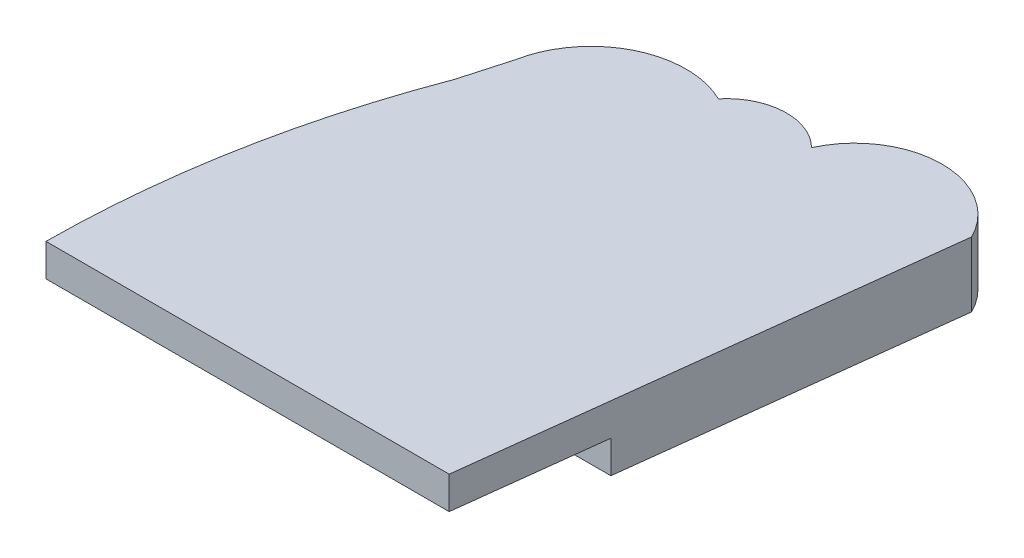
ISO-10303-21;
HEADER;
FILE_DESCRIPTION(('STEP AP214'),'2;1');
FILE_NAME('part.step','',(''),(''),'','','');
FILE_SCHEMA(('AUTOMOTIVE_DESIGN { 1 0 10303 214 1 1 1 1 }'));
ENDSEC;
DATA;
#1=APPLICATION_CONTEXT('core data for automotive mechanical design processes');
#2=APPLICATION_PROTOCOL_DEFINITION('international standard','automotive_design',2000,#1);
#3=PRODUCT_CONTEXT('',#1,'mechanical');
#4=PRODUCT('Part','Part','',(#3));
#5=PRODUCT_RELATED_PRODUCT_CATEGORY('part','',(#4));
#6=PRODUCT_DEFINITION_FORMATION('','',#4);
#7=PRODUCT_DEFINITION_CONTEXT('part definition',#1,'design');
#8=PRODUCT_DEFINITION('design','',#6,#7);
#9=PRODUCT_DEFINITION_SHAPE('','',#8);
#10=(LENGTH_UNIT() NAMED_UNIT(*) SI_UNIT(.MILLI.,.METRE.));
#11=(NAMED_UNIT(*) PLANE_ANGLE_UNIT() SI_UNIT($,.RADIAN.));
#12=(NAMED_UNIT(*) SI_UNIT($,.STERADIAN.) SOLID_ANGLE_UNIT());
#13=UNCERTAINTY_MEASURE_WITH_UNIT(LENGTH_MEASURE(1.E-05),#10,'distance_accuracy_value','');
#14=(GEOMETRIC_REPRESENTATION_CONTEXT(3) GLOBAL_UNCERTAINTY_ASSIGNED_CONTEXT((#13)) GLOBAL_UNIT_ASSIGNED_CONTEXT((#10,
#11,#12)) REPRESENTATION_CONTEXT('',''));
#15=CARTESIAN_POINT('',(0.,0.,0.));
#16=DIRECTION('',(0.,0.,1.));
#17=DIRECTION('',(1.,0.,0.));
#18=AXIS2_PLACEMENT_3D('',#15,#16,#17);
#19=CARTESIAN_POINT('',(113.450621235206,21.75,99.8017663174114));
#20=DIRECTION('',(0.992936608383073,0.,0.118646077612034));
#21=DIRECTION('',(0.118646077612034,0.,-0.992936608383073));
#22=AXIS2_PLACEMENT_3D('',#19,#20,#21);
#23=PLANE('',#22);
#24=DIRECTION('',(0.118646077612034,0.,-0.992936608383073));
#25=VECTOR('',#24,1.);
#26=CARTESIAN_POINT('',(113.450621235206,15.,99.8017663174114));
#27=LINE('',#26,#25);
#28=CARTESIAN_POINT('',(105.254766199258,15.,168.392019497163));
#29=VERTEX_POINT('',#28);
#30=CARTESIAN_POINT('',(108.839468685106,15.,138.392019497163));
#31=VERTEX_POINT('',#30);
#32=EDGE_CURVE('E50',#29,#31,#27,.T.);
#33=ORIENTED_EDGE('',*,*,#32,.T.);
#34=DIRECTION('',(0.,-1.,0.));
#35=VECTOR('',#34,1.);
#36=CARTESIAN_POINT('',(108.839468685106,21.75,138.392019497163));
#37=LINE('',#36,#35);
#38=CARTESIAN_POINT('',(108.839468685106,8.25,138.392019497163));
#39=VERTEX_POINT('',#38);
#40=EDGE_CURVE('E203',#31,#39,#37,.T.);
#41=ORIENTED_EDGE('',*,*,#40,.T.);
#42=DIRECTION('',(-0.118646077612034,0.,0.992936608383073));
#43=VECTOR('',#42,1.);
#44=CARTESIAN_POINT('',(113.450621235206,8.25,99.8017663174114));
#45=LINE('',#44,#43);
#46=CARTESIAN_POINT('',(116.839136919087,8.25,71.4436331340461));
#47=VERTEX_POINT('',#46);
#48=EDGE_CURVE('E149',#47,#39,#45,.T.);
#49=ORIENTED_EDGE('',*,*,#48,.F.);
#50=DIRECTION('',(0.,-1.,0.));
#51=VECTOR('',#50,1.);
#52=CARTESIAN_POINT('',(116.839136919087,21.75,71.4436331340461));
#53=LINE('',#52,#51);
#54=CARTESIAN_POINT('',(116.839136919087,21.75,71.4436331340461));
#55=VERTEX_POINT('',#54);
#56=EDGE_CURVE('E124',#55,#47,#53,.T.);
#57=ORIENTED_EDGE('',*,*,#56,.F.);
#58=DIRECTION('',(-0.118646077612034,0.,0.992936608383073));
#59=VECTOR('',#58,1.);
#60=CARTESIAN_POINT('',(113.450621235206,21.75,99.8017663174114));
#61=LINE('',#60,#59);
#62=CARTESIAN_POINT('',(105.254766199258,21.75,168.392019497163));
#63=VERTEX_POINT('',#62);
#64=EDGE_CURVE('E148',#55,#63,#61,.T.);
#65=ORIENTED_EDGE('',*,*,#64,.T.);
#66=DIRECTION('',(0.,-1.,0.));
#67=VECTOR('',#66,1.);
#68=CARTESIAN_POINT('',(105.254766199258,21.75,168.392019497163));
#69=LINE('',#68,#67);
#70=EDGE_CURVE('E137',#63,#29,#69,.T.);
#71=ORIENTED_EDGE('',*,*,#70,.T.);
#72=EDGE_LOOP('',(#33,#41,#49,#57,#65,#71));
#73=FACE_BOUND('',#72,.T.);
#74=ADVANCED_FACE('F36',(#73),#23,.T.);
#75=CARTESIAN_POINT('',(226.607768194537,21.75,169.442885886238));
#76=DIRECTION('',(0.,-1.,0.));
#77=DIRECTION('',(0.,0.,-1.));
#78=AXIS2_PLACEMENT_3D('',#75,#76,#77);
#79=CYLINDRICAL_SURFACE('',#78,205.108590526185);
#80=DIRECTION('',(0.,-1.,0.));
#81=VECTOR('',#80,1.);
#82=CARTESIAN_POINT('',(23.8631564187217,21.75,138.392019497163));
#83=LINE('',#82,#81);
#84=CARTESIAN_POINT('',(23.8631564187217,15.,138.392019497163));
#85=VERTEX_POINT('',#84);
#86=CARTESIAN_POINT('',(23.8631564187217,8.25,138.392019497163));
#87=VERTEX_POINT('',#86);
#88=EDGE_CURVE('E197',#85,#87,#83,.T.);
#89=ORIENTED_EDGE('',*,*,#88,.F.);
#90=CARTESIAN_POINT('',(226.607768194537,15.,169.442885886238));
#91=DIRECTION('',(0.,-1.,0.));
#92=DIRECTION('',(0.,0.,-1.));
#93=AXIS2_PLACEMENT_3D('',#90,#91,#92);
#94=CIRCLE('',#93,205.108590526185);
#95=CARTESIAN_POINT('',(21.5018697238431,15.,168.392019497163));
#96=VERTEX_POINT('',#95);
#97=EDGE_CURVE('E198',#96,#85,#94,.T.);
#98=ORIENTED_EDGE('',*,*,#97,.F.);
#99=DIRECTION('',(0.,-1.,0.));
#100=VECTOR('',#99,1.);
#101=CARTESIAN_POINT('',(21.5018697238431,21.75,168.392019497163));
#102=LINE('',#101,#100);
#103=CARTESIAN_POINT('',(21.5018697238431,21.75,168.392019497163));
#104=VERTEX_POINT('',#103);
#105=EDGE_CURVE('E140',#104,#96,#102,.T.);
#106=ORIENTED_EDGE('',*,*,#105,.F.);
#107=CARTESIAN_POINT('',(226.607768194537,21.75,169.442885886238));
#108=DIRECTION('',(0.,1.,0.));
#109=DIRECTION('',(0.,0.,1.));
#110=AXIS2_PLACEMENT_3D('',#107,#108,#109);
#111=CIRCLE('',#110,205.108590526185);
#112=CARTESIAN_POINT('',(34.7853182098476,21.75,96.822767533886));
#113=VERTEX_POINT('',#112);
#114=EDGE_CURVE('E59',#113,#104,#111,.T.);
#115=ORIENTED_EDGE('',*,*,#114,.F.);
#116=DIRECTION('',(0.,-1.,0.));
#117=VECTOR('',#116,1.);
#118=CARTESIAN_POINT('',(34.7853182098476,21.75,96.822767533886));
#119=LINE('',#118,#117);
#120=CARTESIAN_POINT('',(34.7853182098476,8.25,96.822767533886));
#121=VERTEX_POINT('',#120);
#122=EDGE_CURVE('E126',#113,#121,#119,.T.);
#123=ORIENTED_EDGE('',*,*,#122,.T.);
#124=CARTESIAN_POINT('',(226.607768194537,8.25,169.442885886238));
#125=DIRECTION('',(0.,1.,0.));
#126=DIRECTION('',(0.,0.,1.));
#127=AXIS2_PLACEMENT_3D('',#124,#125,#126);
#128=CIRCLE('',#127,205.108590526185);
#129=EDGE_CURVE('E84',#121,#87,#128,.T.);
#130=ORIENTED_EDGE('',*,*,#129,.T.);
#131=EDGE_LOOP('',(#89,#98,#106,#115,#123,#130));
#132=FACE_BOUND('',#131,.T.);
#133=ADVANCED_FACE('F174',(#132),#79,.T.);
#134=CARTESIAN_POINT('',(37.2193540619975,8.25,90.6928858862381));
#135=DIRECTION('',(0.,1.,0.));
#136=DIRECTION('',(0.,0.,1.));
#137=AXIS2_PLACEMENT_3D('',#134,#135,#136);
#138=PLANE('',#137);
#139=DIRECTION('',(1.,0.,0.));
#140=VECTOR('',#139,1.);
#141=CARTESIAN_POINT('',(37.2193540619975,8.25,138.392019497163));
#142=LINE('',#141,#140);
#143=EDGE_CURVE('E11',#87,#39,#142,.T.);
#144=ORIENTED_EDGE('',*,*,#143,.F.);
#145=ORIENTED_EDGE('',*,*,#129,.F.);
#146=CARTESIAN_POINT('',(37.5761668096674,8.25,86.9518447177438));
#147=CARTESIAN_POINT('',(36.2249381380187,8.25,91.8995280702332));
#148=CARTESIAN_POINT('',(34.7853182098476,8.25,96.822767533886));
#149=B_SPLINE_CURVE_WITH_KNOTS('',2,(#146,#147,#148),.UNSPECIFIED.,.F.,.F.,(3,3),
(0.221662646060155,1.),.UNSPECIFIED.);
#150=CARTESIAN_POINT('',(37.5761668096674,8.25,86.9518447177438));
#151=VERTEX_POINT('',#150);
#152=EDGE_CURVE('E212',#151,#121,#149,.T.);
#153=ORIENTED_EDGE('',*,*,#152,.F.);
#154=CARTESIAN_POINT('',(57.0094330479288,8.25,90.69288182531));
#155=DIRECTION('',(0.,1.,0.));
#156=DIRECTION('',(0.,0.,1.));
#157=AXIS2_PLACEMENT_3D('',#154,#155,#156);
#158=CIRCLE('',#157,19.7900782041743);
#159=CARTESIAN_POINT('',(65.6976283444023,8.25,72.9119240947019));
#160=VERTEX_POINT('',#159);
#161=EDGE_CURVE('E216',#151,#160,#158,.F.);
#162=ORIENTED_EDGE('',*,*,#161,.T.);
#163=CARTESIAN_POINT('',(75.3329787960748,8.25,80.8816169817695));
#164=DIRECTION('',(0.,1.,0.));
#165=DIRECTION('',(0.,0.,1.));
#166=AXIS2_PLACEMENT_3D('',#163,#164,#165);
#167=CIRCLE('',#166,12.5042386029987);
#168=CARTESIAN_POINT('',(84.1530179179057,8.25,72.0180458656732));
#169=VERTEX_POINT('',#168);
#170=EDGE_CURVE('E121',#169,#160,#167,.T.);
#171=ORIENTED_EDGE('',*,*,#170,.F.);
#172=CARTESIAN_POINT('',(100.633030436561,8.25,79.5239513157429));
#173=DIRECTION('',(0.,1.,0.));
#174=DIRECTION('',(0.,0.,1.));
#175=AXIS2_PLACEMENT_3D('',#172,#173,#174);
#176=CIRCLE('',#175,18.1088218622977);
#177=EDGE_CURVE('E152',#47,#169,#176,.T.);
#178=ORIENTED_EDGE('',*,*,#177,.F.);
#179=ORIENTED_EDGE('',*,*,#48,.T.);
#180=EDGE_LOOP('',(#144,#145,#153,#162,#171,#178,#179));
#181=FACE_BOUND('',#180,.T.);
#182=ADVANCED_FACE('F190',(#181),#138,.F.);
#183=CARTESIAN_POINT('',(0.,21.75,168.392019497163));
#184=DIRECTION('',(0.,0.,1.));
#185=DIRECTION('',(1.,0.,0.));
#186=AXIS2_PLACEMENT_3D('',#183,#184,#185);
#187=PLANE('',#186);
#188=ORIENTED_EDGE('',*,*,#105,.T.);
#189=DIRECTION('',(1.,0.,0.));
#190=VECTOR('',#189,1.);
#191=CARTESIAN_POINT('',(0.,15.,168.392019497163));
#192=LINE('',#191,#190);
#193=EDGE_CURVE('E43',#96,#29,#192,.T.);
#194=ORIENTED_EDGE('',*,*,#193,.T.);
#195=ORIENTED_EDGE('',*,*,#70,.F.);
#196=DIRECTION('',(-1.,0.,0.));
#197=VECTOR('',#196,1.);
#198=CARTESIAN_POINT('',(0.,21.75,168.392019497163));
#199=LINE('',#198,#197);
#200=EDGE_CURVE('E154',#63,#104,#199,.T.);
#201=ORIENTED_EDGE('',*,*,#200,.T.);
#202=EDGE_LOOP('',(#188,#194,#195,#201));
#203=FACE_BOUND('',#202,.T.);
#204=ADVANCED_FACE('F134',(#203),#187,.T.);
#205=CARTESIAN_POINT('',(37.2193540619975,21.75,90.6928858862381));
#206=DIRECTION('',(0.,1.,0.));
#207=DIRECTION('',(0.,0.,1.));
#208=AXIS2_PLACEMENT_3D('',#205,#206,#207);
#209=PLANE('',#208);
#210=ORIENTED_EDGE('',*,*,#114,.T.);
#211=ORIENTED_EDGE('',*,*,#200,.F.);
#212=ORIENTED_EDGE('',*,*,#64,.F.);
#213=CARTESIAN_POINT('',(100.633030436561,21.75,79.5239513157429));
#214=DIRECTION('',(0.,1.,0.));
#215=DIRECTION('',(0.,0.,1.));
#216=AXIS2_PLACEMENT_3D('',#213,#214,#215);
#217=CIRCLE('',#216,18.1088218622977);
#218=CARTESIAN_POINT('',(84.1530179179057,21.75,72.0180458656732));
#219=VERTEX_POINT('',#218);
#220=EDGE_CURVE('E92',#55,#219,#217,.T.);
#221=ORIENTED_EDGE('',*,*,#220,.T.);
#222=CARTESIAN_POINT('',(75.3329787960748,21.75,80.8816169817695));
#223=DIRECTION('',(0.,1.,0.));
#224=DIRECTION('',(0.,0.,1.));
#225=AXIS2_PLACEMENT_3D('',#222,#223,#224);
#226=CIRCLE('',#225,12.5042386029987);
#227=CARTESIAN_POINT('',(65.6976283444023,21.75,72.9119240947019));
#228=VERTEX_POINT('',#227);
#229=EDGE_CURVE('E114',#219,#228,#226,.T.);
#230=ORIENTED_EDGE('',*,*,#229,.T.);
#231=CARTESIAN_POINT('',(57.0094330479288,21.75,90.69288182531));
#232=DIRECTION('',(0.,1.,0.));
#233=DIRECTION('',(0.,0.,1.));
#234=AXIS2_PLACEMENT_3D('',#231,#232,#233);
#235=CIRCLE('',#234,19.7900782041743);
#236=CARTESIAN_POINT('',(37.5761668096674,21.75,86.9518447177438));
#237=VERTEX_POINT('',#236);
#238=EDGE_CURVE('E103',#237,#228,#235,.F.);
#239=ORIENTED_EDGE('',*,*,#238,.F.);
#240=CARTESIAN_POINT('',(37.5761668096674,21.75,86.9518447177438));
#241=CARTESIAN_POINT('',(36.2249381380187,21.75,91.8995280702332));
#242=CARTESIAN_POINT('',(34.7853182098476,21.75,96.822767533886));
#243=B_SPLINE_CURVE_WITH_KNOTS('',2,(#240,#241,#242),.UNSPECIFIED.,.F.,.F.,(3,3),
(0.221662646060155,1.),.UNSPECIFIED.);
#244=EDGE_CURVE('E113',#237,#113,#243,.T.);
#245=ORIENTED_EDGE('',*,*,#244,.T.);
#246=EDGE_LOOP('',(#210,#211,#212,#221,#230,#239,#245));
#247=FACE_BOUND('',#246,.T.);
#248=ADVANCED_FACE('F116',(#247),#209,.T.);
#249=CARTESIAN_POINT('',(100.633030436561,21.75,79.5239513157429));
#250=DIRECTION('',(0.,-1.,0.));
#251=DIRECTION('',(0.,0.,-1.));
#252=AXIS2_PLACEMENT_3D('',#249,#250,#251);
#253=CYLINDRICAL_SURFACE('',#252,18.1088218622977);
#254=ORIENTED_EDGE('',*,*,#177,.T.);
#255=DIRECTION('',(0.,-1.,0.));
#256=VECTOR('',#255,1.);
#257=CARTESIAN_POINT('',(84.1530179179057,21.75,72.0180458656732));
#258=LINE('',#257,#256);
#259=EDGE_CURVE('E122',#219,#169,#258,.T.);
#260=ORIENTED_EDGE('',*,*,#259,.F.);
#261=ORIENTED_EDGE('',*,*,#220,.F.);
#262=ORIENTED_EDGE('',*,*,#56,.T.);
#263=EDGE_LOOP('',(#254,#260,#261,#262));
#264=FACE_BOUND('',#263,.T.);
#265=ADVANCED_FACE('F179',(#264),#253,.T.);
#266=CARTESIAN_POINT('',(75.3329787960748,21.75,80.8816169817695));
#267=DIRECTION('',(0.,-1.,0.));
#268=DIRECTION('',(0.,0.,-1.));
#269=AXIS2_PLACEMENT_3D('',#266,#267,#268);
#270=CYLINDRICAL_SURFACE('',#269,12.5042386029987);
#271=ORIENTED_EDGE('',*,*,#170,.T.);
#272=DIRECTION('',(0.,-1.,0.));
#273=VECTOR('',#272,1.);
#274=CARTESIAN_POINT('',(65.6976283444023,21.75,72.9119240947019));
#275=LINE('',#274,#273);
#276=EDGE_CURVE('E108',#228,#160,#275,.T.);
#277=ORIENTED_EDGE('',*,*,#276,.F.);
#278=ORIENTED_EDGE('',*,*,#229,.F.);
#279=ORIENTED_EDGE('',*,*,#259,.T.);
#280=EDGE_LOOP('',(#271,#277,#278,#279));
#281=FACE_BOUND('',#280,.T.);
#282=ADVANCED_FACE('F120',(#281),#270,.T.);
#283=CARTESIAN_POINT('',(57.0094330479288,21.75,90.69288182531));
#284=DIRECTION('',(0.,-1.,0.));
#285=DIRECTION('',(0.,0.,-1.));
#286=AXIS2_PLACEMENT_3D('',#283,#284,#285);
#287=CYLINDRICAL_SURFACE('',#286,19.7900782041743);
#288=ORIENTED_EDGE('',*,*,#161,.F.);
#289=DIRECTION('',(0.,-1.,0.));
#290=VECTOR('',#289,1.);
#291=CARTESIAN_POINT('',(37.5761668096674,21.75,86.9518447177438));
#292=LINE('',#291,#290);
#293=EDGE_CURVE('E111',#237,#151,#292,.T.);
#294=ORIENTED_EDGE('',*,*,#293,.F.);
#295=ORIENTED_EDGE('',*,*,#238,.T.);
#296=ORIENTED_EDGE('',*,*,#276,.T.);
#297=EDGE_LOOP('',(#288,#294,#295,#296));
#298=FACE_BOUND('',#297,.T.);
#299=ADVANCED_FACE('F106',(#298),#287,.T.);
#300=DIRECTION('',(0.,-1.,0.));
#301=VECTOR('',#300,1.);
#302=SURFACE_OF_LINEAR_EXTRUSION('',#243,#301);
#303=ORIENTED_EDGE('',*,*,#152,.T.);
#304=ORIENTED_EDGE('',*,*,#122,.F.);
#305=ORIENTED_EDGE('',*,*,#244,.F.);
#306=ORIENTED_EDGE('',*,*,#293,.T.);
#307=EDGE_LOOP('',(#303,#304,#305,#306));
#308=FACE_BOUND('',#307,.T.);
#309=ADVANCED_FACE('F168',(#308),#302,.F.);
#310=CARTESIAN_POINT('',(116.839136919087,4.65274580487284,138.392019497163));
#311=DIRECTION('',(0.,0.,1.));
#312=DIRECTION('',(1.,0.,0.));
#313=AXIS2_PLACEMENT_3D('',#310,#311,#312);
#314=PLANE('',#313);
#315=DIRECTION('',(-1.,0.,0.));
#316=VECTOR('',#315,1.);
#317=CARTESIAN_POINT('',(116.839136919087,15.,138.392019497163));
#318=LINE('',#317,#316);
#319=EDGE_CURVE('E226',#31,#85,#318,.T.);
#320=ORIENTED_EDGE('',*,*,#319,.T.);
#321=ORIENTED_EDGE('',*,*,#88,.T.);
#322=ORIENTED_EDGE('',*,*,#143,.T.);
#323=ORIENTED_EDGE('',*,*,#40,.F.);
#324=EDGE_LOOP('',(#320,#321,#322,#323));
#325=FACE_BOUND('',#324,.T.);
#326=ADVANCED_FACE('F172',(#325),#314,.T.);
#327=CARTESIAN_POINT('',(116.839136919087,15.,138.392019497163));
#328=DIRECTION('',(0.,-1.,0.));
#329=DIRECTION('',(0.,0.,-1.));
#330=AXIS2_PLACEMENT_3D('',#327,#328,#329);
#331=PLANE('',#330);
#332=ORIENTED_EDGE('',*,*,#193,.F.);
#333=ORIENTED_EDGE('',*,*,#97,.T.);
#334=ORIENTED_EDGE('',*,*,#319,.F.);
#335=ORIENTED_EDGE('',*,*,#32,.F.);
#336=EDGE_LOOP('',(#332,#333,#334,#335));
#337=FACE_BOUND('',#336,.T.);
#338=ADVANCED_FACE('F228',(#337),#331,.T.);
#339=CLOSED_SHELL('',(#74,#133,#182,#204,#248,#265,#282,#299,#309,#326,#338));
#340=MANIFOLD_SOLID_BREP('B2',#339);
#341=ADVANCED_BREP_SHAPE_REPRESENTATION('',(#18,#340),#14);
#342=SHAPE_DEFINITION_REPRESENTATION(#9,#341);
ENDSEC;
END-ISO-10303-21;
